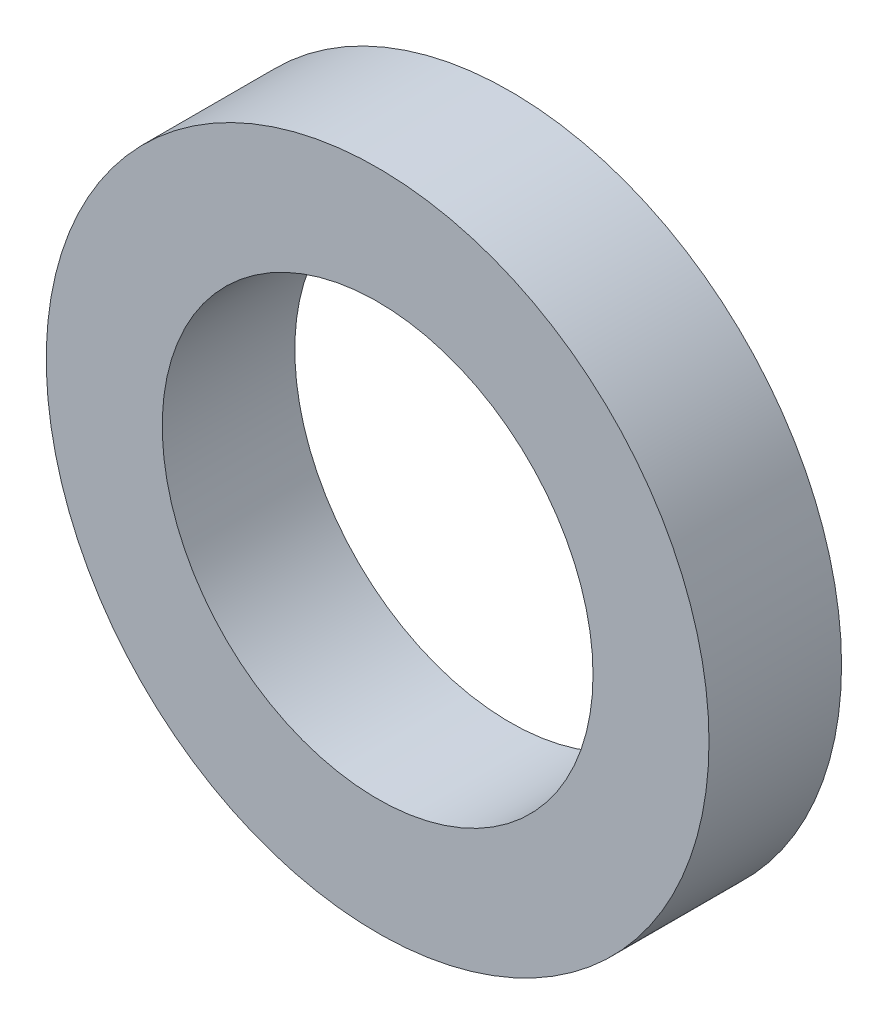
ISO-10303-21;
HEADER;
FILE_DESCRIPTION(('STEP AP214'),'2;1');
FILE_NAME('part.step','',(''),(''),'','','');
FILE_SCHEMA(('AUTOMOTIVE_DESIGN { 1 0 10303 214 1 1 1 1 }'));
ENDSEC;
DATA;
#1=APPLICATION_CONTEXT('core data for automotive mechanical design processes');
#2=APPLICATION_PROTOCOL_DEFINITION('international standard','automotive_design',2000,#1);
#3=PRODUCT_CONTEXT('',#1,'mechanical');
#4=PRODUCT('Part','Part','',(#3));
#5=PRODUCT_RELATED_PRODUCT_CATEGORY('part','',(#4));
#6=PRODUCT_DEFINITION_FORMATION('','',#4);
#7=PRODUCT_DEFINITION_CONTEXT('part definition',#1,'design');
#8=PRODUCT_DEFINITION('design','',#6,#7);
#9=PRODUCT_DEFINITION_SHAPE('','',#8);
#10=(LENGTH_UNIT() NAMED_UNIT(*) SI_UNIT(.MILLI.,.METRE.));
#11=(NAMED_UNIT(*) PLANE_ANGLE_UNIT() SI_UNIT($,.RADIAN.));
#12=(NAMED_UNIT(*) SI_UNIT($,.STERADIAN.) SOLID_ANGLE_UNIT());
#13=UNCERTAINTY_MEASURE_WITH_UNIT(LENGTH_MEASURE(1.E-05),#10,'distance_accuracy_value','');
#14=(GEOMETRIC_REPRESENTATION_CONTEXT(3) GLOBAL_UNCERTAINTY_ASSIGNED_CONTEXT((#13)) GLOBAL_UNIT_ASSIGNED_CONTEXT((#10,
#11,#12)) REPRESENTATION_CONTEXT('',''));
#15=CARTESIAN_POINT('',(0.,0.,0.));
#16=DIRECTION('',(0.,0.,1.));
#17=DIRECTION('',(1.,0.,0.));
#18=AXIS2_PLACEMENT_3D('',#15,#16,#17);
#19=CARTESIAN_POINT('',(0.,0.,2.));
#20=DIRECTION('',(0.,0.,1.));
#21=DIRECTION('',(1.,0.,0.));
#22=AXIS2_PLACEMENT_3D('',#19,#20,#21);
#23=PLANE('',#22);
#24=CARTESIAN_POINT('',(0.,0.,2.));
#25=DIRECTION('',(0.,0.,1.));
#26=DIRECTION('',(1.,0.,0.));
#27=AXIS2_PLACEMENT_3D('',#24,#25,#26);
#28=CIRCLE('',#27,5.);
#29=CARTESIAN_POINT('',(5.,0.,2.));
#30=VERTEX_POINT('',#29);
#31=EDGE_CURVE('E10',#30,#30,#28,.T.);
#32=ORIENTED_EDGE('',*,*,#31,.T.);
#33=EDGE_LOOP('',(#32));
#34=FACE_BOUND('',#33,.T.);
#35=CARTESIAN_POINT('',(0.,0.,2.));
#36=DIRECTION('',(0.,0.,1.));
#37=DIRECTION('',(1.,0.,0.));
#38=AXIS2_PLACEMENT_3D('',#35,#36,#37);
#39=CIRCLE('',#38,3.25);
#40=CARTESIAN_POINT('',(3.25,0.,2.));
#41=VERTEX_POINT('',#40);
#42=EDGE_CURVE('E50',#41,#41,#39,.T.);
#43=ORIENTED_EDGE('',*,*,#42,.F.);
#44=EDGE_LOOP('',(#43));
#45=FACE_BOUND('',#44,.T.);
#46=ADVANCED_FACE('F37',(#34,#45),#23,.T.);
#47=CARTESIAN_POINT('',(0.,0.,0.));
#48=DIRECTION('',(0.,0.,1.));
#49=DIRECTION('',(1.,0.,0.));
#50=AXIS2_PLACEMENT_3D('',#47,#48,#49);
#51=PLANE('',#50);
#52=CARTESIAN_POINT('',(0.,0.,0.));
#53=DIRECTION('',(0.,0.,1.));
#54=DIRECTION('',(1.,0.,0.));
#55=AXIS2_PLACEMENT_3D('',#52,#53,#54);
#56=CIRCLE('',#55,5.);
#57=CARTESIAN_POINT('',(5.,0.,0.));
#58=VERTEX_POINT('',#57);
#59=EDGE_CURVE('E41',#58,#58,#56,.T.);
#60=ORIENTED_EDGE('',*,*,#59,.F.);
#61=EDGE_LOOP('',(#60));
#62=FACE_BOUND('',#61,.T.);
#63=CARTESIAN_POINT('',(0.,0.,0.));
#64=DIRECTION('',(0.,0.,1.));
#65=DIRECTION('',(1.,0.,0.));
#66=AXIS2_PLACEMENT_3D('',#63,#64,#65);
#67=CIRCLE('',#66,3.25);
#68=CARTESIAN_POINT('',(3.25,0.,0.));
#69=VERTEX_POINT('',#68);
#70=EDGE_CURVE('E52',#69,#69,#67,.T.);
#71=ORIENTED_EDGE('',*,*,#70,.T.);
#72=EDGE_LOOP('',(#71));
#73=FACE_BOUND('',#72,.T.);
#74=ADVANCED_FACE('F64',(#62,#73),#51,.F.);
#75=CARTESIAN_POINT('',(0.,0.,2.));
#76=DIRECTION('',(0.,0.,-1.));
#77=DIRECTION('',(-1.,0.,0.));
#78=AXIS2_PLACEMENT_3D('',#75,#76,#77);
#79=CYLINDRICAL_SURFACE('',#78,5.);
#80=ORIENTED_EDGE('',*,*,#31,.F.);
#81=EDGE_LOOP('',(#80));
#82=FACE_BOUND('',#81,.T.);
#83=ORIENTED_EDGE('',*,*,#59,.T.);
#84=EDGE_LOOP('',(#83));
#85=FACE_BOUND('',#84,.T.);
#86=ADVANCED_FACE('F39',(#82,#85),#79,.T.);
#87=CARTESIAN_POINT('',(0.,0.,2.));
#88=DIRECTION('',(0.,0.,-1.));
#89=DIRECTION('',(-1.,0.,0.));
#90=AXIS2_PLACEMENT_3D('',#87,#88,#89);
#91=CYLINDRICAL_SURFACE('',#90,3.25);
#92=ORIENTED_EDGE('',*,*,#42,.T.);
#93=EDGE_LOOP('',(#92));
#94=FACE_BOUND('',#93,.T.);
#95=ORIENTED_EDGE('',*,*,#70,.F.);
#96=EDGE_LOOP('',(#95));
#97=FACE_BOUND('',#96,.T.);
#98=ADVANCED_FACE('F60',(#94,#97),#91,.F.);
#99=CLOSED_SHELL('',(#46,#74,#86,#98));
#100=MANIFOLD_SOLID_BREP('B2',#99);
#101=ADVANCED_BREP_SHAPE_REPRESENTATION('',(#18,#100),#14);
#102=SHAPE_DEFINITION_REPRESENTATION(#9,#101);
ENDSEC;
END-ISO-10303-21;
